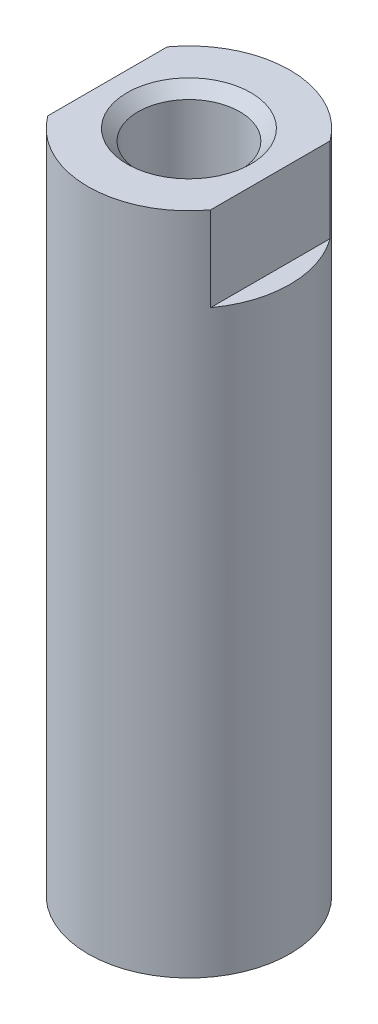
ISO-10303-21;
HEADER;
FILE_DESCRIPTION(('STEP AP214'),'2;1');
FILE_NAME('part.step','',(''),(''),'','','');
FILE_SCHEMA(('AUTOMOTIVE_DESIGN { 1 0 10303 214 1 1 1 1 }'));
ENDSEC;
DATA;
#1=APPLICATION_CONTEXT('core data for automotive mechanical design processes');
#2=APPLICATION_PROTOCOL_DEFINITION('international standard','automotive_design',2000,#1);
#3=PRODUCT_CONTEXT('',#1,'mechanical');
#4=PRODUCT('Part','Part','',(#3));
#5=PRODUCT_RELATED_PRODUCT_CATEGORY('part','',(#4));
#6=PRODUCT_DEFINITION_FORMATION('','',#4);
#7=PRODUCT_DEFINITION_CONTEXT('part definition',#1,'design');
#8=PRODUCT_DEFINITION('design','',#6,#7);
#9=PRODUCT_DEFINITION_SHAPE('','',#8);
#10=(LENGTH_UNIT() NAMED_UNIT(*) SI_UNIT(.MILLI.,.METRE.));
#11=(NAMED_UNIT(*) PLANE_ANGLE_UNIT() SI_UNIT($,.RADIAN.));
#12=(NAMED_UNIT(*) SI_UNIT($,.STERADIAN.) SOLID_ANGLE_UNIT());
#13=UNCERTAINTY_MEASURE_WITH_UNIT(LENGTH_MEASURE(1.E-05),#10,'distance_accuracy_value','');
#14=(GEOMETRIC_REPRESENTATION_CONTEXT(3) GLOBAL_UNCERTAINTY_ASSIGNED_CONTEXT((#13)) GLOBAL_UNIT_ASSIGNED_CONTEXT((#10,
#11,#12)) REPRESENTATION_CONTEXT('',''));
#15=CARTESIAN_POINT('',(0.,0.,0.));
#16=DIRECTION('',(0.,0.,1.));
#17=DIRECTION('',(1.,0.,0.));
#18=AXIS2_PLACEMENT_3D('',#15,#16,#17);
#19=CARTESIAN_POINT('',(0.,14.224,-1.98374));
#20=DIRECTION('',(0.,1.,0.));
#21=DIRECTION('',(0.,0.,1.));
#22=AXIS2_PLACEMENT_3D('',#19,#20,#21);
#23=PLANE('',#22);
#24=CARTESIAN_POINT('',(0.,14.224,0.));
#25=DIRECTION('',(0.,1.,0.));
#26=DIRECTION('',(0.,0.,1.));
#27=AXIS2_PLACEMENT_3D('',#24,#25,#26);
#28=CIRCLE('',#27,1.98374);
#29=CARTESIAN_POINT('',(0.,14.224,1.98374));
#30=VERTEX_POINT('',#29);
#31=EDGE_CURVE('E20',#30,#30,#28,.T.);
#32=ORIENTED_EDGE('',*,*,#31,.T.);
#33=EDGE_LOOP('',(#32));
#34=FACE_BOUND('',#33,.T.);
#35=ADVANCED_FACE('F17',(#34),#23,.T.);
#36=CARTESIAN_POINT('',(0.,14.224,0.));
#37=DIRECTION('',(0.,1.,0.));
#38=DIRECTION('',(0.,0.,1.));
#39=AXIS2_PLACEMENT_3D('',#36,#37,#38);
#40=CYLINDRICAL_SURFACE('',#39,1.98374);
#41=CARTESIAN_POINT('',(0.,25.4787399999827,0.));
#42=DIRECTION('',(0.,1.,0.));
#43=DIRECTION('',(0.,0.,1.));
#44=AXIS2_PLACEMENT_3D('',#41,#42,#43);
#45=CIRCLE('',#44,1.98374000001422);
#46=CARTESIAN_POINT('',(0.,25.4787399999827,1.98374000001422));
#47=VERTEX_POINT('',#46);
#48=EDGE_CURVE('E99',#47,#47,#45,.T.);
#49=ORIENTED_EDGE('',*,*,#48,.T.);
#50=EDGE_LOOP('',(#49));
#51=FACE_BOUND('',#50,.T.);
#52=ORIENTED_EDGE('',*,*,#31,.F.);
#53=EDGE_LOOP('',(#52));
#54=FACE_BOUND('',#53,.T.);
#55=ADVANCED_FACE('F178',(#51,#54),#40,.F.);
#56=CARTESIAN_POINT('',(0.,25.9079999999585,0.));
#57=DIRECTION('',(0.,1.,0.));
#58=DIRECTION('',(-1.,0.,0.));
#59=AXIS2_PLACEMENT_3D('',#56,#57,#58);
#60=CONICAL_SURFACE('',#59,2.41299999993316,0.785398163397448);
#61=CARTESIAN_POINT('',(0.,25.9080000000154,0.));
#62=DIRECTION('',(0.,1.,0.));
#63=DIRECTION('',(-1.,0.,0.));
#64=AXIS2_PLACEMENT_3D('',#61,#62,#63);
#65=CIRCLE('',#64,2.41299999999001);
#66=CARTESIAN_POINT('',(-2.41299999999001,25.9080000000154,0.));
#67=VERTEX_POINT('',#66);
#68=EDGE_CURVE('E68',#67,#67,#65,.T.);
#69=ORIENTED_EDGE('',*,*,#68,.T.);
#70=EDGE_LOOP('',(#69));
#71=FACE_BOUND('',#70,.T.);
#72=ORIENTED_EDGE('',*,*,#48,.F.);
#73=EDGE_LOOP('',(#72));
#74=FACE_BOUND('',#73,.T.);
#75=ADVANCED_FACE('F168',(#71,#74),#60,.F.);
#76=CARTESIAN_POINT('',(3.937,0.,0.));
#77=DIRECTION('',(0.,1.,0.));
#78=DIRECTION('',(0.,0.,1.));
#79=AXIS2_PLACEMENT_3D('',#76,#77,#78);
#80=PLANE('',#79);
#81=CARTESIAN_POINT('',(0.,0.,0.));
#82=DIRECTION('',(0.,1.,0.));
#83=DIRECTION('',(0.,0.,1.));
#84=AXIS2_PLACEMENT_3D('',#81,#82,#83);
#85=CIRCLE('',#84,3.937);
#86=CARTESIAN_POINT('',(0.,0.,3.937));
#87=VERTEX_POINT('',#86);
#88=EDGE_CURVE('E84',#87,#87,#85,.T.);
#89=ORIENTED_EDGE('',*,*,#88,.F.);
#90=EDGE_LOOP('',(#89));
#91=FACE_BOUND('',#90,.T.);
#92=ADVANCED_FACE('F158',(#91),#80,.F.);
#93=CARTESIAN_POINT('',(0.,22.606,0.));
#94=DIRECTION('',(0.,1.,0.));
#95=DIRECTION('',(0.,0.,1.));
#96=AXIS2_PLACEMENT_3D('',#93,#94,#95);
#97=PLANE('',#96);
#98=CARTESIAN_POINT('',(0.,22.606,0.));
#99=DIRECTION('',(0.,1.,0.));
#100=DIRECTION('',(0.,0.,1.));
#101=AXIS2_PLACEMENT_3D('',#98,#99,#100);
#102=CIRCLE('',#101,3.937);
#103=CARTESIAN_POINT('',(-3.175,22.606,2.32794845303757));
#104=VERTEX_POINT('',#103);
#105=CARTESIAN_POINT('',(-3.175,22.606,-2.32794845303757));
#106=VERTEX_POINT('',#105);
#107=EDGE_CURVE('E77',#104,#106,#102,.F.);
#108=ORIENTED_EDGE('',*,*,#107,.F.);
#109=DIRECTION('',(0.,0.,1.));
#110=VECTOR('',#109,1.);
#111=CARTESIAN_POINT('',(-3.175,22.606,-7.874));
#112=LINE('',#111,#110);
#113=EDGE_CURVE('E69',#106,#104,#112,.T.);
#114=ORIENTED_EDGE('',*,*,#113,.F.);
#115=EDGE_LOOP('',(#108,#114));
#116=FACE_BOUND('',#115,.T.);
#117=ADVANCED_FACE('F149',(#116),#97,.T.);
#118=CARTESIAN_POINT('',(-3.175,22.606,-7.874));
#119=DIRECTION('',(-1.,0.,0.));
#120=DIRECTION('',(0.,0.,1.));
#121=AXIS2_PLACEMENT_3D('',#118,#119,#120);
#122=PLANE('',#121);
#123=DIRECTION('',(0.,1.,0.));
#124=VECTOR('',#123,1.);
#125=CARTESIAN_POINT('',(-3.175,0.,2.32794845303757));
#126=LINE('',#125,#124);
#127=CARTESIAN_POINT('',(-3.175,25.908,2.32794845303757));
#128=VERTEX_POINT('',#127);
#129=EDGE_CURVE('E72',#128,#104,#126,.F.);
#130=ORIENTED_EDGE('',*,*,#129,.F.);
#131=DIRECTION('',(0.,0.,-1.));
#132=VECTOR('',#131,1.);
#133=CARTESIAN_POINT('',(-3.175,25.908,0.));
#134=LINE('',#133,#132);
#135=CARTESIAN_POINT('',(-3.175,25.908,-2.32794845303757));
#136=VERTEX_POINT('',#135);
#137=EDGE_CURVE('E57',#128,#136,#134,.T.);
#138=ORIENTED_EDGE('',*,*,#137,.T.);
#139=DIRECTION('',(0.,1.,0.));
#140=VECTOR('',#139,1.);
#141=CARTESIAN_POINT('',(-3.175,0.,-2.32794845303757));
#142=LINE('',#141,#140);
#143=EDGE_CURVE('E97',#106,#136,#142,.T.);
#144=ORIENTED_EDGE('',*,*,#143,.F.);
#145=ORIENTED_EDGE('',*,*,#113,.T.);
#146=EDGE_LOOP('',(#130,#138,#144,#145));
#147=FACE_BOUND('',#146,.T.);
#148=ADVANCED_FACE('F73',(#147),#122,.T.);
#149=CARTESIAN_POINT('',(0.,25.908,0.));
#150=DIRECTION('',(0.,-1.,0.));
#151=DIRECTION('',(0.,0.,-1.));
#152=AXIS2_PLACEMENT_3D('',#149,#150,#151);
#153=PLANE('',#152);
#154=ORIENTED_EDGE('',*,*,#68,.F.);
#155=EDGE_LOOP('',(#154));
#156=FACE_BOUND('',#155,.T.);
#157=CARTESIAN_POINT('',(0.,25.908,0.));
#158=DIRECTION('',(0.,1.,0.));
#159=DIRECTION('',(0.,0.,1.));
#160=AXIS2_PLACEMENT_3D('',#157,#158,#159);
#161=CIRCLE('',#160,3.937);
#162=CARTESIAN_POINT('',(3.175,25.908,-2.32794845303757));
#163=VERTEX_POINT('',#162);
#164=EDGE_CURVE('E64',#136,#163,#161,.F.);
#165=ORIENTED_EDGE('',*,*,#164,.F.);
#166=ORIENTED_EDGE('',*,*,#137,.F.);
#167=CARTESIAN_POINT('',(0.,25.908,0.));
#168=DIRECTION('',(0.,1.,0.));
#169=DIRECTION('',(0.,0.,1.));
#170=AXIS2_PLACEMENT_3D('',#167,#168,#169);
#171=CIRCLE('',#170,3.937);
#172=CARTESIAN_POINT('',(3.175,25.908,2.32794845303757));
#173=VERTEX_POINT('',#172);
#174=EDGE_CURVE('E61',#173,#128,#171,.F.);
#175=ORIENTED_EDGE('',*,*,#174,.F.);
#176=DIRECTION('',(0.,0.,-1.));
#177=VECTOR('',#176,1.);
#178=CARTESIAN_POINT('',(3.175,25.908,7.874));
#179=LINE('',#178,#177);
#180=EDGE_CURVE('E52',#163,#173,#179,.F.);
#181=ORIENTED_EDGE('',*,*,#180,.F.);
#182=EDGE_LOOP('',(#165,#166,#175,#181));
#183=FACE_BOUND('',#182,.T.);
#184=ADVANCED_FACE('F59',(#156,#183),#153,.F.);
#185=CARTESIAN_POINT('',(3.175,22.606,7.874));
#186=DIRECTION('',(1.,0.,0.));
#187=DIRECTION('',(0.,0.,-1.));
#188=AXIS2_PLACEMENT_3D('',#185,#186,#187);
#189=PLANE('',#188);
#190=DIRECTION('',(0.,1.,0.));
#191=VECTOR('',#190,1.);
#192=CARTESIAN_POINT('',(3.175,0.,-2.32794845303757));
#193=LINE('',#192,#191);
#194=CARTESIAN_POINT('',(3.175,22.606,-2.32794845303757));
#195=VERTEX_POINT('',#194);
#196=EDGE_CURVE('E26',#163,#195,#193,.F.);
#197=ORIENTED_EDGE('',*,*,#196,.F.);
#198=ORIENTED_EDGE('',*,*,#180,.T.);
#199=DIRECTION('',(0.,1.,0.));
#200=VECTOR('',#199,1.);
#201=CARTESIAN_POINT('',(3.175,0.,2.32794845303757));
#202=LINE('',#201,#200);
#203=CARTESIAN_POINT('',(3.175,22.606,2.32794845303757));
#204=VERTEX_POINT('',#203);
#205=EDGE_CURVE('E82',#204,#173,#202,.T.);
#206=ORIENTED_EDGE('',*,*,#205,.F.);
#207=DIRECTION('',(0.,0.,1.));
#208=VECTOR('',#207,1.);
#209=CARTESIAN_POINT('',(3.175,22.606,0.));
#210=LINE('',#209,#208);
#211=EDGE_CURVE('E35',#195,#204,#210,.T.);
#212=ORIENTED_EDGE('',*,*,#211,.F.);
#213=EDGE_LOOP('',(#197,#198,#206,#212));
#214=FACE_BOUND('',#213,.T.);
#215=ADVANCED_FACE('F104',(#214),#189,.T.);
#216=CARTESIAN_POINT('',(0.,22.606,0.));
#217=DIRECTION('',(0.,1.,0.));
#218=DIRECTION('',(0.,0.,1.));
#219=AXIS2_PLACEMENT_3D('',#216,#217,#218);
#220=PLANE('',#219);
#221=ORIENTED_EDGE('',*,*,#211,.T.);
#222=CARTESIAN_POINT('',(0.,22.606,0.));
#223=DIRECTION('',(0.,1.,0.));
#224=DIRECTION('',(0.,0.,1.));
#225=AXIS2_PLACEMENT_3D('',#222,#223,#224);
#226=CIRCLE('',#225,3.937);
#227=EDGE_CURVE('E11',#195,#204,#226,.F.);
#228=ORIENTED_EDGE('',*,*,#227,.F.);
#229=EDGE_LOOP('',(#221,#228));
#230=FACE_BOUND('',#229,.T.);
#231=ADVANCED_FACE('F106',(#230),#220,.T.);
#232=CARTESIAN_POINT('',(0.,0.,0.));
#233=DIRECTION('',(0.,1.,0.));
#234=DIRECTION('',(0.,0.,1.));
#235=AXIS2_PLACEMENT_3D('',#232,#233,#234);
#236=CYLINDRICAL_SURFACE('',#235,3.937);
#237=ORIENTED_EDGE('',*,*,#196,.T.);
#238=ORIENTED_EDGE('',*,*,#227,.T.);
#239=ORIENTED_EDGE('',*,*,#205,.T.);
#240=ORIENTED_EDGE('',*,*,#174,.T.);
#241=ORIENTED_EDGE('',*,*,#129,.T.);
#242=ORIENTED_EDGE('',*,*,#107,.T.);
#243=ORIENTED_EDGE('',*,*,#143,.T.);
#244=ORIENTED_EDGE('',*,*,#164,.T.);
#245=EDGE_LOOP('',(#237,#238,#239,#240,#241,#242,#243,#244));
#246=FACE_BOUND('',#245,.T.);
#247=ORIENTED_EDGE('',*,*,#88,.T.);
#248=EDGE_LOOP('',(#247));
#249=FACE_BOUND('',#248,.T.);
#250=ADVANCED_FACE('F80',(#246,#249),#236,.T.);
#251=CLOSED_SHELL('',(#35,#55,#75,#92,#117,#148,#184,#215,#231,#250));
#252=MANIFOLD_SOLID_BREP('B1',#251);
#253=ADVANCED_BREP_SHAPE_REPRESENTATION('',(#18,#252),#14);
#254=SHAPE_DEFINITION_REPRESENTATION(#9,#253);
ENDSEC;
END-ISO-10303-21;
